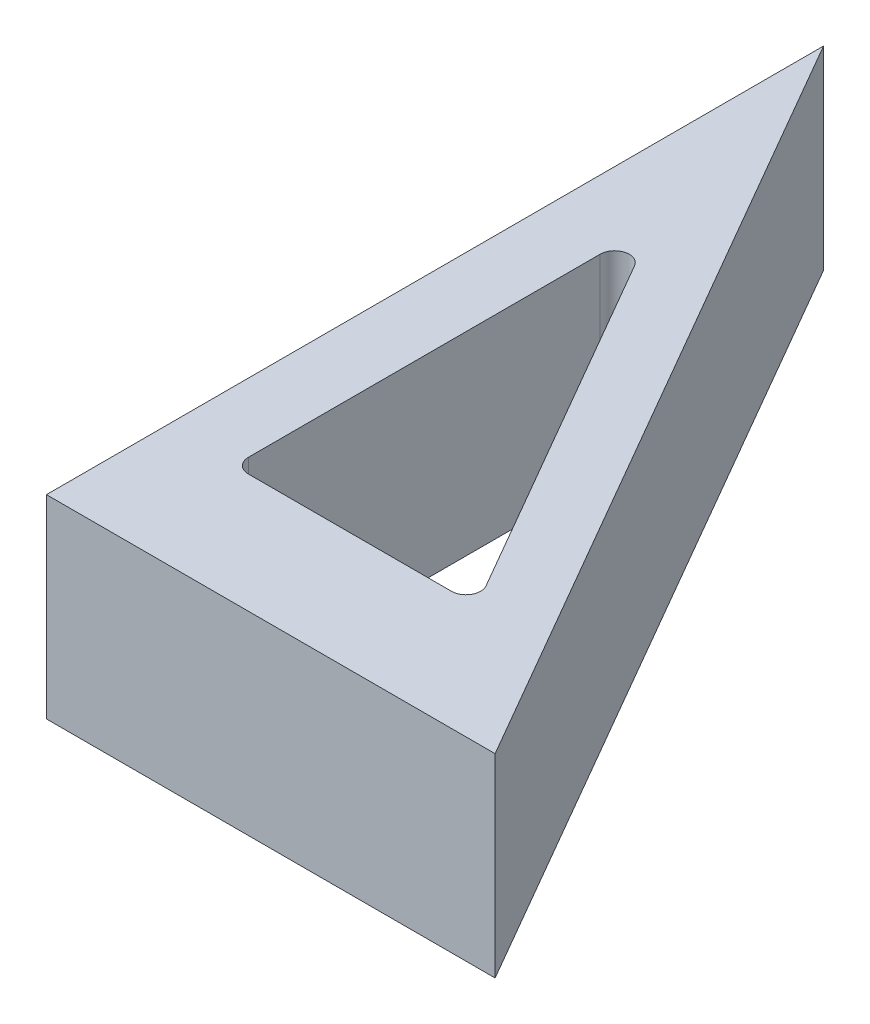
ISO-10303-21;
HEADER;
FILE_DESCRIPTION(('STEP AP214'),'2;1');
FILE_NAME('part.step','',(''),(''),'','','');
FILE_SCHEMA(('AUTOMOTIVE_DESIGN { 1 0 10303 214 1 1 1 1 }'));
ENDSEC;
DATA;
#1=APPLICATION_CONTEXT('core data for automotive mechanical design processes');
#2=APPLICATION_PROTOCOL_DEFINITION('international standard','automotive_design',2000,#1);
#3=PRODUCT_CONTEXT('',#1,'mechanical');
#4=PRODUCT('Part','Part','',(#3));
#5=PRODUCT_RELATED_PRODUCT_CATEGORY('part','',(#4));
#6=PRODUCT_DEFINITION_FORMATION('','',#4);
#7=PRODUCT_DEFINITION_CONTEXT('part definition',#1,'design');
#8=PRODUCT_DEFINITION('design','',#6,#7);
#9=PRODUCT_DEFINITION_SHAPE('','',#8);
#10=(LENGTH_UNIT() NAMED_UNIT(*) SI_UNIT(.MILLI.,.METRE.));
#11=(NAMED_UNIT(*) PLANE_ANGLE_UNIT() SI_UNIT($,.RADIAN.));
#12=(NAMED_UNIT(*) SI_UNIT($,.STERADIAN.) SOLID_ANGLE_UNIT());
#13=UNCERTAINTY_MEASURE_WITH_UNIT(LENGTH_MEASURE(1.E-05),#10,'distance_accuracy_value','');
#14=(GEOMETRIC_REPRESENTATION_CONTEXT(3) GLOBAL_UNCERTAINTY_ASSIGNED_CONTEXT((#13)) GLOBAL_UNIT_ASSIGNED_CONTEXT((#10,
#11,#12)) REPRESENTATION_CONTEXT('',''));
#15=CARTESIAN_POINT('',(0.,0.,0.));
#16=DIRECTION('',(0.,0.,1.));
#17=DIRECTION('',(1.,0.,0.));
#18=AXIS2_PLACEMENT_3D('',#15,#16,#17);
#19=CARTESIAN_POINT('',(46.1880215351706,20.,0.));
#20=DIRECTION('',(0.,0.,-1.));
#21=DIRECTION('',(-1.,0.,0.));
#22=AXIS2_PLACEMENT_3D('',#19,#20,#21);
#23=PLANE('',#22);
#24=DIRECTION('',(1.,0.,0.));
#25=VECTOR('',#24,1.);
#26=CARTESIAN_POINT('',(46.1880215351706,0.,0.));
#27=LINE('',#26,#25);
#28=CARTESIAN_POINT('',(0.,0.,0.));
#29=VERTEX_POINT('',#28);
#30=CARTESIAN_POINT('',(46.1880215351706,0.,0.));
#31=VERTEX_POINT('',#30);
#32=EDGE_CURVE('E131',#29,#31,#27,.T.);
#33=ORIENTED_EDGE('',*,*,#32,.T.);
#34=DIRECTION('',(0.,-1.,0.));
#35=VECTOR('',#34,1.);
#36=CARTESIAN_POINT('',(46.1880215351706,20.,0.));
#37=LINE('',#36,#35);
#38=CARTESIAN_POINT('',(46.1880215351706,20.,0.));
#39=VERTEX_POINT('',#38);
#40=EDGE_CURVE('E114',#39,#31,#37,.T.);
#41=ORIENTED_EDGE('',*,*,#40,.F.);
#42=DIRECTION('',(1.,0.,0.));
#43=VECTOR('',#42,1.);
#44=CARTESIAN_POINT('',(46.1880215351706,20.,0.));
#45=LINE('',#44,#43);
#46=CARTESIAN_POINT('',(0.,20.,0.));
#47=VERTEX_POINT('',#46);
#48=EDGE_CURVE('E121',#47,#39,#45,.T.);
#49=ORIENTED_EDGE('',*,*,#48,.F.);
#50=DIRECTION('',(0.,-1.,0.));
#51=VECTOR('',#50,1.);
#52=CARTESIAN_POINT('',(0.,20.,0.));
#53=LINE('',#52,#51);
#54=EDGE_CURVE('E136',#47,#29,#53,.T.);
#55=ORIENTED_EDGE('',*,*,#54,.T.);
#56=EDGE_LOOP('',(#33,#41,#49,#55));
#57=FACE_BOUND('',#56,.T.);
#58=ADVANCED_FACE('F39',(#57),#23,.F.);
#59=CARTESIAN_POINT('',(0.,20.,-80.));
#60=DIRECTION('',(-0.866025403784436,0.,0.500000000000004));
#61=DIRECTION('',(0.500000000000004,0.,0.866025403784436));
#62=AXIS2_PLACEMENT_3D('',#59,#60,#61);
#63=PLANE('',#62);
#64=DIRECTION('',(-0.500000000000004,0.,-0.866025403784436));
#65=VECTOR('',#64,1.);
#66=CARTESIAN_POINT('',(0.,0.,-80.));
#67=LINE('',#66,#65);
#68=CARTESIAN_POINT('',(0.,0.,-80.));
#69=VERTEX_POINT('',#68);
#70=EDGE_CURVE('E188',#31,#69,#67,.T.);
#71=ORIENTED_EDGE('',*,*,#70,.T.);
#72=DIRECTION('',(0.,-1.,0.));
#73=VECTOR('',#72,1.);
#74=CARTESIAN_POINT('',(0.,20.,-80.));
#75=LINE('',#74,#73);
#76=CARTESIAN_POINT('',(0.,20.,-80.));
#77=VERTEX_POINT('',#76);
#78=EDGE_CURVE('E117',#77,#69,#75,.T.);
#79=ORIENTED_EDGE('',*,*,#78,.F.);
#80=DIRECTION('',(-0.500000000000004,0.,-0.866025403784436));
#81=VECTOR('',#80,1.);
#82=CARTESIAN_POINT('',(0.,20.,-80.));
#83=LINE('',#82,#81);
#84=EDGE_CURVE('E110',#39,#77,#83,.T.);
#85=ORIENTED_EDGE('',*,*,#84,.F.);
#86=ORIENTED_EDGE('',*,*,#40,.T.);
#87=EDGE_LOOP('',(#71,#79,#85,#86));
#88=FACE_BOUND('',#87,.T.);
#89=ADVANCED_FACE('F112',(#88),#63,.F.);
#90=CARTESIAN_POINT('',(0.,20.,0.));
#91=DIRECTION('',(1.,0.,0.));
#92=DIRECTION('',(0.,0.,-1.));
#93=AXIS2_PLACEMENT_3D('',#90,#91,#92);
#94=PLANE('',#93);
#95=DIRECTION('',(0.,0.,1.));
#96=VECTOR('',#95,1.);
#97=CARTESIAN_POINT('',(0.,0.,0.));
#98=LINE('',#97,#96);
#99=EDGE_CURVE('E128',#69,#29,#98,.T.);
#100=ORIENTED_EDGE('',*,*,#99,.T.);
#101=ORIENTED_EDGE('',*,*,#54,.F.);
#102=DIRECTION('',(0.,0.,1.));
#103=VECTOR('',#102,1.);
#104=CARTESIAN_POINT('',(0.,20.,0.));
#105=LINE('',#104,#103);
#106=EDGE_CURVE('E120',#77,#47,#105,.T.);
#107=ORIENTED_EDGE('',*,*,#106,.F.);
#108=ORIENTED_EDGE('',*,*,#78,.T.);
#109=EDGE_LOOP('',(#100,#101,#107,#108));
#110=FACE_BOUND('',#109,.T.);
#111=ADVANCED_FACE('F194',(#110),#94,.F.);
#112=CARTESIAN_POINT('',(0.,20.,0.));
#113=DIRECTION('',(0.,-1.,0.));
#114=DIRECTION('',(0.,0.,-1.));
#115=AXIS2_PLACEMENT_3D('',#112,#113,#114);
#116=PLANE('',#115);
#117=DIRECTION('',(0.,0.,1.));
#118=VECTOR('',#117,1.);
#119=CARTESIAN_POINT('',(7.06267384505686,20.,-55.5341801261483));
#120=LINE('',#119,#118);
#121=CARTESIAN_POINT('',(7.06267384505686,20.,-49.9361039147949));
#122=VERTEX_POINT('',#121);
#123=CARTESIAN_POINT('',(7.06267384505686,20.,-13.7329099369263));
#124=VERTEX_POINT('',#123);
#125=EDGE_CURVE('E163',#122,#124,#120,.T.);
#126=ORIENTED_EDGE('',*,*,#125,.F.);
#127=CARTESIAN_POINT('',(8.56267384505686,20.,-49.9361039147949));
#128=DIRECTION('',(0.,-1.,0.));
#129=DIRECTION('',(0.,0.,-1.));
#130=AXIS2_PLACEMENT_3D('',#127,#128,#129);
#131=CIRCLE('',#130,1.5);
#132=CARTESIAN_POINT('',(9.86171195073352,20.,-50.6861039147949));
#133=VERTEX_POINT('',#132);
#134=EDGE_CURVE('E47',#122,#133,#131,.T.);
#135=ORIENTED_EDGE('',*,*,#134,.T.);
#136=DIRECTION('',(-0.5,0.,-0.866025403784439));
#137=VECTOR('',#136,1.);
#138=CARTESIAN_POINT('',(32.0626738450569,20.,-12.2329099369263));
#139=LINE('',#138,#137);
#140=CARTESIAN_POINT('',(30.7636357393802,20.,-14.4829099369263));
#141=VERTEX_POINT('',#140);
#142=EDGE_CURVE('E162',#141,#133,#139,.T.);
#143=ORIENTED_EDGE('',*,*,#142,.F.);
#144=CARTESIAN_POINT('',(29.4645976337036,20.,-13.7329099369263));
#145=DIRECTION('',(0.,-1.,0.));
#146=DIRECTION('',(0.,0.,-1.));
#147=AXIS2_PLACEMENT_3D('',#144,#145,#146);
#148=CIRCLE('',#147,1.5);
#149=CARTESIAN_POINT('',(29.4645976337036,20.,-12.2329099369263));
#150=VERTEX_POINT('',#149);
#151=EDGE_CURVE('E151',#141,#150,#148,.T.);
#152=ORIENTED_EDGE('',*,*,#151,.T.);
#153=DIRECTION('',(1.,0.,0.));
#154=VECTOR('',#153,1.);
#155=CARTESIAN_POINT('',(7.06267384505686,20.,-12.2329099369263));
#156=LINE('',#155,#154);
#157=CARTESIAN_POINT('',(8.56267384505686,20.,-12.2329099369263));
#158=VERTEX_POINT('',#157);
#159=EDGE_CURVE('E180',#158,#150,#156,.T.);
#160=ORIENTED_EDGE('',*,*,#159,.F.);
#161=CARTESIAN_POINT('',(8.56267384505686,20.,-13.7329099369263));
#162=DIRECTION('',(0.,-1.,0.));
#163=DIRECTION('',(0.,0.,-1.));
#164=AXIS2_PLACEMENT_3D('',#161,#162,#163);
#165=CIRCLE('',#164,1.5);
#166=EDGE_CURVE('E155',#158,#124,#165,.T.);
#167=ORIENTED_EDGE('',*,*,#166,.T.);
#168=EDGE_LOOP('',(#126,#135,#143,#152,#160,#167));
#169=FACE_BOUND('',#168,.T.);
#170=ORIENTED_EDGE('',*,*,#48,.T.);
#171=ORIENTED_EDGE('',*,*,#84,.T.);
#172=ORIENTED_EDGE('',*,*,#106,.T.);
#173=EDGE_LOOP('',(#170,#171,#172));
#174=FACE_BOUND('',#173,.T.);
#175=ADVANCED_FACE('F124',(#169,#174),#116,.F.);
#176=CARTESIAN_POINT('',(0.,0.,0.));
#177=DIRECTION('',(0.,-1.,0.));
#178=DIRECTION('',(0.,0.,-1.));
#179=AXIS2_PLACEMENT_3D('',#176,#177,#178);
#180=PLANE('',#179);
#181=DIRECTION('',(1.,0.,0.));
#182=VECTOR('',#181,1.);
#183=CARTESIAN_POINT('',(7.06267384505686,0.,-12.2329099369263));
#184=LINE('',#183,#182);
#185=CARTESIAN_POINT('',(8.56267384505686,0.,-12.2329099369263));
#186=VERTEX_POINT('',#185);
#187=CARTESIAN_POINT('',(29.4645976337036,0.,-12.2329099369263));
#188=VERTEX_POINT('',#187);
#189=EDGE_CURVE('E175',#186,#188,#184,.T.);
#190=ORIENTED_EDGE('',*,*,#189,.T.);
#191=CARTESIAN_POINT('',(29.4645976337036,0.,-13.7329099369263));
#192=DIRECTION('',(0.,-1.,0.));
#193=DIRECTION('',(0.,0.,-1.));
#194=AXIS2_PLACEMENT_3D('',#191,#192,#193);
#195=CIRCLE('',#194,1.5);
#196=CARTESIAN_POINT('',(30.7636357393802,0.,-14.4829099369263));
#197=VERTEX_POINT('',#196);
#198=EDGE_CURVE('E153',#188,#197,#195,.F.);
#199=ORIENTED_EDGE('',*,*,#198,.T.);
#200=DIRECTION('',(-0.5,0.,-0.866025403784439));
#201=VECTOR('',#200,1.);
#202=CARTESIAN_POINT('',(32.0626738450569,0.,-12.2329099369263));
#203=LINE('',#202,#201);
#204=CARTESIAN_POINT('',(9.86171195073352,0.,-50.6861039147949));
#205=VERTEX_POINT('',#204);
#206=EDGE_CURVE('E176',#197,#205,#203,.T.);
#207=ORIENTED_EDGE('',*,*,#206,.T.);
#208=CARTESIAN_POINT('',(8.56267384505686,0.,-49.9361039147949));
#209=DIRECTION('',(0.,-1.,0.));
#210=DIRECTION('',(0.,0.,-1.));
#211=AXIS2_PLACEMENT_3D('',#208,#209,#210);
#212=CIRCLE('',#211,1.5);
#213=CARTESIAN_POINT('',(7.06267384505686,0.,-49.9361039147949));
#214=VERTEX_POINT('',#213);
#215=EDGE_CURVE('E11',#205,#214,#212,.F.);
#216=ORIENTED_EDGE('',*,*,#215,.T.);
#217=DIRECTION('',(0.,0.,1.));
#218=VECTOR('',#217,1.);
#219=CARTESIAN_POINT('',(7.06267384505686,0.,-55.5341801261483));
#220=LINE('',#219,#218);
#221=CARTESIAN_POINT('',(7.06267384505686,0.,-13.7329099369263));
#222=VERTEX_POINT('',#221);
#223=EDGE_CURVE('E173',#214,#222,#220,.T.);
#224=ORIENTED_EDGE('',*,*,#223,.T.);
#225=CARTESIAN_POINT('',(8.56267384505686,0.,-13.7329099369263));
#226=DIRECTION('',(0.,-1.,0.));
#227=DIRECTION('',(0.,0.,-1.));
#228=AXIS2_PLACEMENT_3D('',#225,#226,#227);
#229=CIRCLE('',#228,1.5);
#230=EDGE_CURVE('E157',#222,#186,#229,.F.);
#231=ORIENTED_EDGE('',*,*,#230,.T.);
#232=EDGE_LOOP('',(#190,#199,#207,#216,#224,#231));
#233=FACE_BOUND('',#232,.T.);
#234=ORIENTED_EDGE('',*,*,#32,.F.);
#235=ORIENTED_EDGE('',*,*,#99,.F.);
#236=ORIENTED_EDGE('',*,*,#70,.F.);
#237=EDGE_LOOP('',(#234,#235,#236));
#238=FACE_BOUND('',#237,.T.);
#239=ADVANCED_FACE('F193',(#233,#238),#180,.T.);
#240=CARTESIAN_POINT('',(32.0626738450569,0.,-12.2329099369263));
#241=DIRECTION('',(0.866025403784439,0.,-0.5));
#242=DIRECTION('',(-0.5,0.,-0.866025403784439));
#243=AXIS2_PLACEMENT_3D('',#240,#241,#242);
#244=PLANE('',#243);
#245=ORIENTED_EDGE('',*,*,#206,.F.);
#246=DIRECTION('',(0.,1.,0.));
#247=VECTOR('',#246,1.);
#248=CARTESIAN_POINT('',(30.7636357393802,20.,-14.4829099369263));
#249=LINE('',#248,#247);
#250=EDGE_CURVE('E134',#197,#141,#249,.T.);
#251=ORIENTED_EDGE('',*,*,#250,.T.);
#252=ORIENTED_EDGE('',*,*,#142,.T.);
#253=DIRECTION('',(0.,1.,0.));
#254=VECTOR('',#253,1.);
#255=CARTESIAN_POINT('',(9.86171195073352,0.,-50.6861039147949));
#256=LINE('',#255,#254);
#257=EDGE_CURVE('E132',#133,#205,#256,.F.);
#258=ORIENTED_EDGE('',*,*,#257,.T.);
#259=EDGE_LOOP('',(#245,#251,#252,#258));
#260=FACE_BOUND('',#259,.T.);
#261=ADVANCED_FACE('F169',(#260),#244,.F.);
#262=CARTESIAN_POINT('',(7.06267384505686,0.,-12.2329099369263));
#263=DIRECTION('',(0.,0.,1.));
#264=DIRECTION('',(1.,0.,0.));
#265=AXIS2_PLACEMENT_3D('',#262,#263,#264);
#266=PLANE('',#265);
#267=ORIENTED_EDGE('',*,*,#159,.T.);
#268=DIRECTION('',(0.,1.,0.));
#269=VECTOR('',#268,1.);
#270=CARTESIAN_POINT('',(29.4645976337036,0.,-12.2329099369263));
#271=LINE('',#270,#269);
#272=EDGE_CURVE('E145',#150,#188,#271,.F.);
#273=ORIENTED_EDGE('',*,*,#272,.T.);
#274=ORIENTED_EDGE('',*,*,#189,.F.);
#275=DIRECTION('',(0.,1.,0.));
#276=VECTOR('',#275,1.);
#277=CARTESIAN_POINT('',(8.56267384505686,20.,-12.2329099369263));
#278=LINE('',#277,#276);
#279=EDGE_CURVE('E142',#186,#158,#278,.T.);
#280=ORIENTED_EDGE('',*,*,#279,.T.);
#281=EDGE_LOOP('',(#267,#273,#274,#280));
#282=FACE_BOUND('',#281,.T.);
#283=ADVANCED_FACE('F222',(#282),#266,.F.);
#284=CARTESIAN_POINT('',(7.06267384505686,0.,-55.5341801261483));
#285=DIRECTION('',(-1.,0.,0.));
#286=DIRECTION('',(0.,0.,1.));
#287=AXIS2_PLACEMENT_3D('',#284,#285,#286);
#288=PLANE('',#287);
#289=ORIENTED_EDGE('',*,*,#125,.T.);
#290=DIRECTION('',(0.,1.,0.));
#291=VECTOR('',#290,1.);
#292=CARTESIAN_POINT('',(7.06267384505686,0.,-13.7329099369263));
#293=LINE('',#292,#291);
#294=EDGE_CURVE('E54',#124,#222,#293,.F.);
#295=ORIENTED_EDGE('',*,*,#294,.T.);
#296=ORIENTED_EDGE('',*,*,#223,.F.);
#297=DIRECTION('',(0.,1.,0.));
#298=VECTOR('',#297,1.);
#299=CARTESIAN_POINT('',(7.06267384505686,20.,-49.9361039147949));
#300=LINE('',#299,#298);
#301=EDGE_CURVE('E147',#214,#122,#300,.T.);
#302=ORIENTED_EDGE('',*,*,#301,.T.);
#303=EDGE_LOOP('',(#289,#295,#296,#302));
#304=FACE_BOUND('',#303,.T.);
#305=ADVANCED_FACE('F172',(#304),#288,.F.);
#306=CARTESIAN_POINT('',(29.4645976337036,0.,-13.7329099369263));
#307=DIRECTION('',(0.,-1.,0.));
#308=DIRECTION('',(0.,0.,-1.));
#309=AXIS2_PLACEMENT_3D('',#306,#307,#308);
#310=CYLINDRICAL_SURFACE('',#309,1.5);
#311=ORIENTED_EDGE('',*,*,#198,.F.);
#312=ORIENTED_EDGE('',*,*,#272,.F.);
#313=ORIENTED_EDGE('',*,*,#151,.F.);
#314=ORIENTED_EDGE('',*,*,#250,.F.);
#315=EDGE_LOOP('',(#311,#312,#313,#314));
#316=FACE_BOUND('',#315,.T.);
#317=ADVANCED_FACE('F209',(#316),#310,.F.);
#318=CARTESIAN_POINT('',(8.56267384505686,0.,-13.7329099369263));
#319=DIRECTION('',(0.,-1.,0.));
#320=DIRECTION('',(0.,0.,-1.));
#321=AXIS2_PLACEMENT_3D('',#318,#319,#320);
#322=CYLINDRICAL_SURFACE('',#321,1.5);
#323=ORIENTED_EDGE('',*,*,#230,.F.);
#324=ORIENTED_EDGE('',*,*,#294,.F.);
#325=ORIENTED_EDGE('',*,*,#166,.F.);
#326=ORIENTED_EDGE('',*,*,#279,.F.);
#327=EDGE_LOOP('',(#323,#324,#325,#326));
#328=FACE_BOUND('',#327,.T.);
#329=ADVANCED_FACE('F211',(#328),#322,.F.);
#330=CARTESIAN_POINT('',(8.56267384505686,0.,-49.9361039147949));
#331=DIRECTION('',(0.,-1.,0.));
#332=DIRECTION('',(0.,0.,-1.));
#333=AXIS2_PLACEMENT_3D('',#330,#331,#332);
#334=CYLINDRICAL_SURFACE('',#333,1.5);
#335=ORIENTED_EDGE('',*,*,#215,.F.);
#336=ORIENTED_EDGE('',*,*,#257,.F.);
#337=ORIENTED_EDGE('',*,*,#134,.F.);
#338=ORIENTED_EDGE('',*,*,#301,.F.);
#339=EDGE_LOOP('',(#335,#336,#337,#338));
#340=FACE_BOUND('',#339,.T.);
#341=ADVANCED_FACE('F41',(#340),#334,.F.);
#342=CLOSED_SHELL('',(#58,#89,#111,#175,#239,#261,#283,#305,#317,#329,#341));
#343=MANIFOLD_SOLID_BREP('B2',#342);
#344=ADVANCED_BREP_SHAPE_REPRESENTATION('',(#18,#343),#14);
#345=SHAPE_DEFINITION_REPRESENTATION(#9,#344);
ENDSEC;
END-ISO-10303-21;
